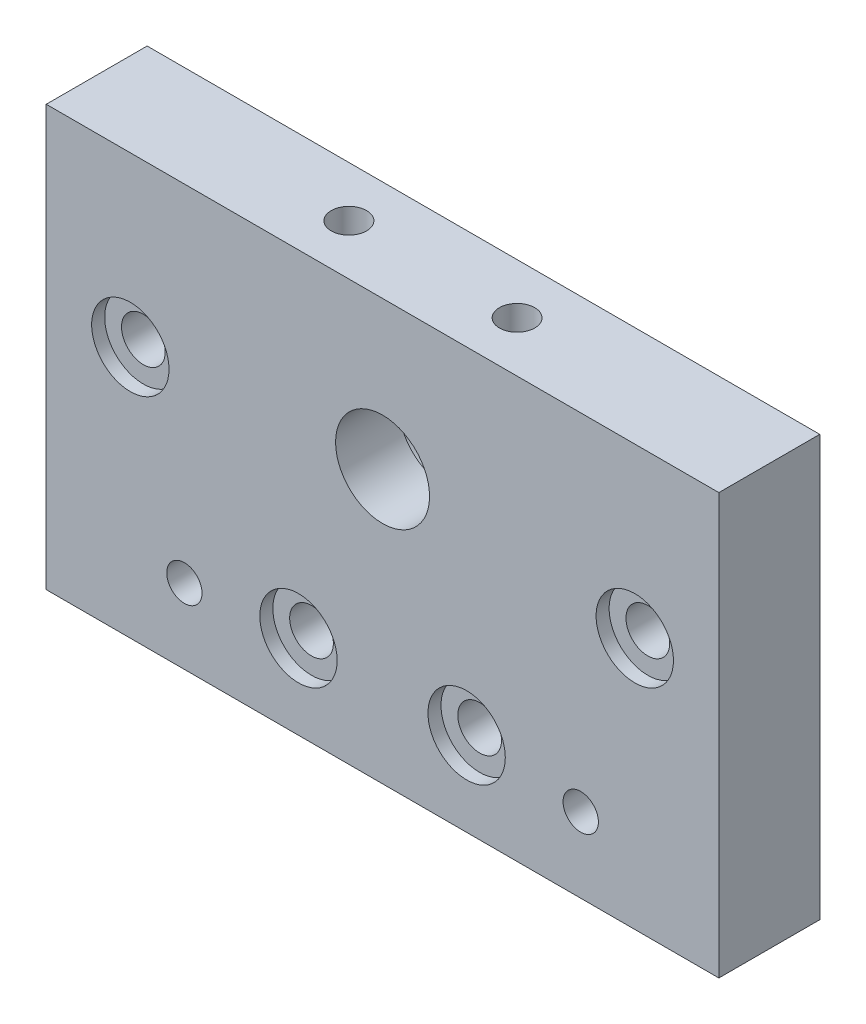
ISO-10303-21;
HEADER;
FILE_DESCRIPTION(('STEP AP214'),'2;1');
FILE_NAME('part.step','',(''),(''),'','','');
FILE_SCHEMA(('AUTOMOTIVE_DESIGN { 1 0 10303 214 1 1 1 1 }'));
ENDSEC;
DATA;
#1=APPLICATION_CONTEXT('core data for automotive mechanical design processes');
#2=APPLICATION_PROTOCOL_DEFINITION('international standard','automotive_design',2000,#1);
#3=PRODUCT_CONTEXT('',#1,'mechanical');
#4=PRODUCT('Part','Part','',(#3));
#5=PRODUCT_RELATED_PRODUCT_CATEGORY('part','',(#4));
#6=PRODUCT_DEFINITION_FORMATION('','',#4);
#7=PRODUCT_DEFINITION_CONTEXT('part definition',#1,'design');
#8=PRODUCT_DEFINITION('design','',#6,#7);
#9=PRODUCT_DEFINITION_SHAPE('','',#8);
#10=(LENGTH_UNIT() NAMED_UNIT(*) SI_UNIT(.MILLI.,.METRE.));
#11=(NAMED_UNIT(*) PLANE_ANGLE_UNIT() SI_UNIT($,.RADIAN.));
#12=(NAMED_UNIT(*) SI_UNIT($,.STERADIAN.) SOLID_ANGLE_UNIT());
#13=UNCERTAINTY_MEASURE_WITH_UNIT(LENGTH_MEASURE(1.E-05),#10,'distance_accuracy_value','');
#14=(GEOMETRIC_REPRESENTATION_CONTEXT(3) GLOBAL_UNCERTAINTY_ASSIGNED_CONTEXT((#13)) GLOBAL_UNIT_ASSIGNED_CONTEXT((#10,
#11,#12)) REPRESENTATION_CONTEXT('',''));
#15=CARTESIAN_POINT('',(0.,0.,0.));
#16=DIRECTION('',(0.,0.,1.));
#17=DIRECTION('',(1.,0.,0.));
#18=AXIS2_PLACEMENT_3D('',#15,#16,#17);
#19=CARTESIAN_POINT('',(40.,32.4,12.));
#20=DIRECTION('',(0.,0.,-1.));
#21=DIRECTION('',(-1.,0.,0.));
#22=AXIS2_PLACEMENT_3D('',#19,#20,#21);
#23=CYLINDRICAL_SURFACE('',#22,5.588);
#24=CARTESIAN_POINT('',(40.,32.4,12.));
#25=DIRECTION('',(0.,0.,1.));
#26=DIRECTION('',(1.,0.,0.));
#27=AXIS2_PLACEMENT_3D('',#24,#25,#26);
#28=CIRCLE('',#27,5.588);
#29=CARTESIAN_POINT('',(45.588,32.4,12.));
#30=VERTEX_POINT('',#29);
#31=EDGE_CURVE('E163',#30,#30,#28,.T.);
#32=ORIENTED_EDGE('',*,*,#31,.T.);
#33=EDGE_LOOP('',(#32));
#34=FACE_BOUND('',#33,.T.);
#35=CARTESIAN_POINT('',(40.,32.4,4.5));
#36=DIRECTION('',(0.,0.,-1.));
#37=DIRECTION('',(-1.,0.,0.));
#38=AXIS2_PLACEMENT_3D('',#35,#36,#37);
#39=CIRCLE('',#38,5.588);
#40=CARTESIAN_POINT('',(34.412,32.4,4.5));
#41=VERTEX_POINT('',#40);
#42=EDGE_CURVE('E36',#41,#41,#39,.T.);
#43=ORIENTED_EDGE('',*,*,#42,.T.);
#44=EDGE_LOOP('',(#43));
#45=FACE_BOUND('',#44,.T.);
#46=ADVANCED_FACE('F32',(#34,#45),#23,.F.);
#47=CARTESIAN_POINT('',(70.,30.,12.));
#48=DIRECTION('',(0.,0.,-1.));
#49=DIRECTION('',(-1.,0.,0.));
#50=AXIS2_PLACEMENT_3D('',#47,#48,#49);
#51=CYLINDRICAL_SURFACE('',#50,2.59999999999999);
#52=CARTESIAN_POINT('',(70.,30.,0.));
#53=DIRECTION('',(0.,0.,1.));
#54=DIRECTION('',(-1.,0.,0.));
#55=AXIS2_PLACEMENT_3D('',#52,#53,#54);
#56=CIRCLE('',#55,2.59999999999999);
#57=CARTESIAN_POINT('',(67.4,30.,0.));
#58=VERTEX_POINT('',#57);
#59=EDGE_CURVE('E151',#58,#58,#56,.T.);
#60=ORIENTED_EDGE('',*,*,#59,.F.);
#61=EDGE_LOOP('',(#60));
#62=FACE_BOUND('',#61,.T.);
#63=CARTESIAN_POINT('',(70.,30.,10.45));
#64=DIRECTION('',(0.,0.,1.));
#65=DIRECTION('',(1.,0.,0.));
#66=AXIS2_PLACEMENT_3D('',#63,#64,#65);
#67=CIRCLE('',#66,2.59999999999999);
#68=CARTESIAN_POINT('',(72.6,30.,10.45));
#69=VERTEX_POINT('',#68);
#70=EDGE_CURVE('E127',#69,#69,#67,.T.);
#71=ORIENTED_EDGE('',*,*,#70,.T.);
#72=EDGE_LOOP('',(#71));
#73=FACE_BOUND('',#72,.T.);
#74=ADVANCED_FACE('F192',(#62,#73),#51,.F.);
#75=CARTESIAN_POINT('',(50.,10.,12.));
#76=DIRECTION('',(0.,0.,-1.));
#77=DIRECTION('',(-1.,0.,0.));
#78=AXIS2_PLACEMENT_3D('',#75,#76,#77);
#79=CYLINDRICAL_SURFACE('',#78,2.59999999999999);
#80=CARTESIAN_POINT('',(50.,10.,0.));
#81=DIRECTION('',(0.,0.,1.));
#82=DIRECTION('',(-1.,0.,0.));
#83=AXIS2_PLACEMENT_3D('',#80,#81,#82);
#84=CIRCLE('',#83,2.59999999999999);
#85=CARTESIAN_POINT('',(47.4,10.,0.));
#86=VERTEX_POINT('',#85);
#87=EDGE_CURVE('E154',#86,#86,#84,.T.);
#88=ORIENTED_EDGE('',*,*,#87,.F.);
#89=EDGE_LOOP('',(#88));
#90=FACE_BOUND('',#89,.T.);
#91=CARTESIAN_POINT('',(50.,10.,10.45));
#92=DIRECTION('',(0.,0.,1.));
#93=DIRECTION('',(1.,0.,0.));
#94=AXIS2_PLACEMENT_3D('',#91,#92,#93);
#95=CIRCLE('',#94,2.59999999999999);
#96=CARTESIAN_POINT('',(52.6,10.,10.45));
#97=VERTEX_POINT('',#96);
#98=EDGE_CURVE('E133',#97,#97,#95,.T.);
#99=ORIENTED_EDGE('',*,*,#98,.T.);
#100=EDGE_LOOP('',(#99));
#101=FACE_BOUND('',#100,.T.);
#102=ADVANCED_FACE('F260',(#90,#101),#79,.F.);
#103=CARTESIAN_POINT('',(30.,10.,12.));
#104=DIRECTION('',(0.,0.,-1.));
#105=DIRECTION('',(-1.,0.,0.));
#106=AXIS2_PLACEMENT_3D('',#103,#104,#105);
#107=CYLINDRICAL_SURFACE('',#106,2.59999999999999);
#108=CARTESIAN_POINT('',(30.,10.,0.));
#109=DIRECTION('',(0.,0.,1.));
#110=DIRECTION('',(1.,0.,0.));
#111=AXIS2_PLACEMENT_3D('',#108,#109,#110);
#112=CIRCLE('',#111,2.59999999999999);
#113=CARTESIAN_POINT('',(32.6,10.,0.));
#114=VERTEX_POINT('',#113);
#115=EDGE_CURVE('E160',#114,#114,#112,.T.);
#116=ORIENTED_EDGE('',*,*,#115,.F.);
#117=EDGE_LOOP('',(#116));
#118=FACE_BOUND('',#117,.T.);
#119=CARTESIAN_POINT('',(30.,10.,10.45));
#120=DIRECTION('',(0.,0.,1.));
#121=DIRECTION('',(1.,0.,0.));
#122=AXIS2_PLACEMENT_3D('',#119,#120,#121);
#123=CIRCLE('',#122,2.59999999999999);
#124=CARTESIAN_POINT('',(32.6,10.,10.45));
#125=VERTEX_POINT('',#124);
#126=EDGE_CURVE('E140',#125,#125,#123,.T.);
#127=ORIENTED_EDGE('',*,*,#126,.T.);
#128=EDGE_LOOP('',(#127));
#129=FACE_BOUND('',#128,.T.);
#130=ADVANCED_FACE('F265',(#118,#129),#107,.F.);
#131=CARTESIAN_POINT('',(9.99999999999999,30.,12.));
#132=DIRECTION('',(0.,0.,-1.));
#133=DIRECTION('',(-1.,0.,0.));
#134=AXIS2_PLACEMENT_3D('',#131,#132,#133);
#135=CYLINDRICAL_SURFACE('',#134,2.6);
#136=CARTESIAN_POINT('',(9.99999999999999,30.,0.));
#137=DIRECTION('',(0.,0.,1.));
#138=DIRECTION('',(1.,0.,0.));
#139=AXIS2_PLACEMENT_3D('',#136,#137,#138);
#140=CIRCLE('',#139,2.6);
#141=CARTESIAN_POINT('',(12.6,30.,0.));
#142=VERTEX_POINT('',#141);
#143=EDGE_CURVE('E157',#142,#142,#140,.T.);
#144=ORIENTED_EDGE('',*,*,#143,.F.);
#145=EDGE_LOOP('',(#144));
#146=FACE_BOUND('',#145,.T.);
#147=CARTESIAN_POINT('',(9.99999999999999,30.,10.45));
#148=DIRECTION('',(0.,0.,1.));
#149=DIRECTION('',(1.,0.,0.));
#150=AXIS2_PLACEMENT_3D('',#147,#148,#149);
#151=CIRCLE('',#150,2.6);
#152=CARTESIAN_POINT('',(12.6,30.,10.45));
#153=VERTEX_POINT('',#152);
#154=EDGE_CURVE('E147',#153,#153,#151,.T.);
#155=ORIENTED_EDGE('',*,*,#154,.T.);
#156=EDGE_LOOP('',(#155));
#157=FACE_BOUND('',#156,.T.);
#158=ADVANCED_FACE('F212',(#146,#157),#135,.F.);
#159=CARTESIAN_POINT('',(0.,0.,12.));
#160=DIRECTION('',(0.,0.,-1.));
#161=DIRECTION('',(-1.,0.,0.));
#162=AXIS2_PLACEMENT_3D('',#159,#160,#161);
#163=PLANE('',#162);
#164=CARTESIAN_POINT('',(16.43,8.9,12.));
#165=DIRECTION('',(0.,0.,1.));
#166=DIRECTION('',(1.,0.,0.));
#167=AXIS2_PLACEMENT_3D('',#164,#165,#166);
#168=CIRCLE('',#167,2.09999999999999);
#169=CARTESIAN_POINT('',(18.53,8.9,12.));
#170=VERTEX_POINT('',#169);
#171=EDGE_CURVE('E111',#170,#170,#168,.T.);
#172=ORIENTED_EDGE('',*,*,#171,.F.);
#173=EDGE_LOOP('',(#172));
#174=FACE_BOUND('',#173,.T.);
#175=CARTESIAN_POINT('',(63.57,8.90000000000001,12.));
#176=DIRECTION('',(0.,0.,1.));
#177=DIRECTION('',(1.,0.,0.));
#178=AXIS2_PLACEMENT_3D('',#175,#176,#177);
#179=CIRCLE('',#178,2.09999999999999);
#180=CARTESIAN_POINT('',(65.67,8.90000000000001,12.));
#181=VERTEX_POINT('',#180);
#182=EDGE_CURVE('E117',#181,#181,#179,.T.);
#183=ORIENTED_EDGE('',*,*,#182,.F.);
#184=EDGE_LOOP('',(#183));
#185=FACE_BOUND('',#184,.T.);
#186=CARTESIAN_POINT('',(70.,30.,12.));
#187=DIRECTION('',(0.,0.,1.));
#188=DIRECTION('',(1.,0.,0.));
#189=AXIS2_PLACEMENT_3D('',#186,#187,#188);
#190=CIRCLE('',#189,4.6);
#191=CARTESIAN_POINT('',(74.6,30.,12.));
#192=VERTEX_POINT('',#191);
#193=EDGE_CURVE('E123',#192,#192,#190,.T.);
#194=ORIENTED_EDGE('',*,*,#193,.F.);
#195=EDGE_LOOP('',(#194));
#196=FACE_BOUND('',#195,.T.);
#197=CARTESIAN_POINT('',(50.,10.,12.));
#198=DIRECTION('',(0.,0.,1.));
#199=DIRECTION('',(1.,0.,0.));
#200=AXIS2_PLACEMENT_3D('',#197,#198,#199);
#201=CIRCLE('',#200,4.6);
#202=CARTESIAN_POINT('',(54.6,10.,12.));
#203=VERTEX_POINT('',#202);
#204=EDGE_CURVE('E134',#203,#203,#201,.T.);
#205=ORIENTED_EDGE('',*,*,#204,.F.);
#206=EDGE_LOOP('',(#205));
#207=FACE_BOUND('',#206,.T.);
#208=CARTESIAN_POINT('',(30.,10.,12.));
#209=DIRECTION('',(0.,0.,1.));
#210=DIRECTION('',(1.,0.,0.));
#211=AXIS2_PLACEMENT_3D('',#208,#209,#210);
#212=CIRCLE('',#211,4.6);
#213=CARTESIAN_POINT('',(34.6,10.,12.));
#214=VERTEX_POINT('',#213);
#215=EDGE_CURVE('E141',#214,#214,#212,.T.);
#216=ORIENTED_EDGE('',*,*,#215,.F.);
#217=EDGE_LOOP('',(#216));
#218=FACE_BOUND('',#217,.T.);
#219=CARTESIAN_POINT('',(9.99999999999999,30.,12.));
#220=DIRECTION('',(0.,0.,1.));
#221=DIRECTION('',(1.,0.,0.));
#222=AXIS2_PLACEMENT_3D('',#219,#220,#221);
#223=CIRCLE('',#222,4.6);
#224=CARTESIAN_POINT('',(14.6,30.,12.));
#225=VERTEX_POINT('',#224);
#226=EDGE_CURVE('E148',#225,#225,#223,.T.);
#227=ORIENTED_EDGE('',*,*,#226,.F.);
#228=EDGE_LOOP('',(#227));
#229=FACE_BOUND('',#228,.T.);
#230=DIRECTION('',(0.,-1.,0.));
#231=VECTOR('',#230,1.);
#232=CARTESIAN_POINT('',(0.,0.,12.));
#233=LINE('',#232,#231);
#234=CARTESIAN_POINT('',(0.,50.,12.));
#235=VERTEX_POINT('',#234);
#236=CARTESIAN_POINT('',(0.,0.,12.));
#237=VERTEX_POINT('',#236);
#238=EDGE_CURVE('E167',#235,#237,#233,.T.);
#239=ORIENTED_EDGE('',*,*,#238,.T.);
#240=DIRECTION('',(1.,0.,0.));
#241=VECTOR('',#240,1.);
#242=CARTESIAN_POINT('',(0.,0.,12.));
#243=LINE('',#242,#241);
#244=CARTESIAN_POINT('',(80.,0.,12.));
#245=VERTEX_POINT('',#244);
#246=EDGE_CURVE('E82',#237,#245,#243,.T.);
#247=ORIENTED_EDGE('',*,*,#246,.T.);
#248=DIRECTION('',(0.,1.,0.));
#249=VECTOR('',#248,1.);
#250=CARTESIAN_POINT('',(80.,0.,12.));
#251=LINE('',#250,#249);
#252=CARTESIAN_POINT('',(80.,50.,12.));
#253=VERTEX_POINT('',#252);
#254=EDGE_CURVE('E170',#245,#253,#251,.T.);
#255=ORIENTED_EDGE('',*,*,#254,.T.);
#256=DIRECTION('',(-1.,0.,0.));
#257=VECTOR('',#256,1.);
#258=CARTESIAN_POINT('',(0.,50.,12.));
#259=LINE('',#258,#257);
#260=EDGE_CURVE('E51',#253,#235,#259,.T.);
#261=ORIENTED_EDGE('',*,*,#260,.T.);
#262=EDGE_LOOP('',(#239,#247,#255,#261));
#263=FACE_BOUND('',#262,.T.);
#264=ORIENTED_EDGE('',*,*,#31,.F.);
#265=EDGE_LOOP('',(#264));
#266=FACE_BOUND('',#265,.T.);
#267=ADVANCED_FACE('F208',(#174,#185,#196,#207,#218,#229,#263,#266),#163,.F.);
#268=CARTESIAN_POINT('',(0.,0.,0.));
#269=DIRECTION('',(0.,0.,-1.));
#270=DIRECTION('',(-1.,0.,0.));
#271=AXIS2_PLACEMENT_3D('',#268,#269,#270);
#272=PLANE('',#271);
#273=CARTESIAN_POINT('',(40.,32.4,0.));
#274=DIRECTION('',(0.,0.,-1.));
#275=DIRECTION('',(-1.,0.,0.));
#276=AXIS2_PLACEMENT_3D('',#273,#274,#275);
#277=CIRCLE('',#276,8.05);
#278=CARTESIAN_POINT('',(31.95,32.4,0.));
#279=VERTEX_POINT('',#278);
#280=EDGE_CURVE('E233',#279,#279,#277,.T.);
#281=ORIENTED_EDGE('',*,*,#280,.F.);
#282=EDGE_LOOP('',(#281));
#283=FACE_BOUND('',#282,.T.);
#284=CARTESIAN_POINT('',(16.43,8.9,0.));
#285=DIRECTION('',(0.,0.,1.));
#286=DIRECTION('',(1.,0.,0.));
#287=AXIS2_PLACEMENT_3D('',#284,#285,#286);
#288=CIRCLE('',#287,2.1);
#289=CARTESIAN_POINT('',(18.53,8.9,0.));
#290=VERTEX_POINT('',#289);
#291=EDGE_CURVE('E114',#290,#290,#288,.T.);
#292=ORIENTED_EDGE('',*,*,#291,.T.);
#293=EDGE_LOOP('',(#292));
#294=FACE_BOUND('',#293,.T.);
#295=CARTESIAN_POINT('',(63.57,8.90000000000001,0.));
#296=DIRECTION('',(0.,0.,1.));
#297=DIRECTION('',(1.,0.,0.));
#298=AXIS2_PLACEMENT_3D('',#295,#296,#297);
#299=CIRCLE('',#298,2.1);
#300=CARTESIAN_POINT('',(65.67,8.90000000000001,0.));
#301=VERTEX_POINT('',#300);
#302=EDGE_CURVE('E120',#301,#301,#299,.T.);
#303=ORIENTED_EDGE('',*,*,#302,.T.);
#304=EDGE_LOOP('',(#303));
#305=FACE_BOUND('',#304,.T.);
#306=ORIENTED_EDGE('',*,*,#87,.T.);
#307=EDGE_LOOP('',(#306));
#308=FACE_BOUND('',#307,.T.);
#309=ORIENTED_EDGE('',*,*,#115,.T.);
#310=EDGE_LOOP('',(#309));
#311=FACE_BOUND('',#310,.T.);
#312=DIRECTION('',(0.,-1.,0.));
#313=VECTOR('',#312,1.);
#314=CARTESIAN_POINT('',(0.,0.,0.));
#315=LINE('',#314,#313);
#316=CARTESIAN_POINT('',(0.,50.,0.));
#317=VERTEX_POINT('',#316);
#318=CARTESIAN_POINT('',(0.,0.,0.));
#319=VERTEX_POINT('',#318);
#320=EDGE_CURVE('E166',#317,#319,#315,.T.);
#321=ORIENTED_EDGE('',*,*,#320,.F.);
#322=DIRECTION('',(-1.,0.,0.));
#323=VECTOR('',#322,1.);
#324=CARTESIAN_POINT('',(0.,50.,0.));
#325=LINE('',#324,#323);
#326=CARTESIAN_POINT('',(80.,50.,0.));
#327=VERTEX_POINT('',#326);
#328=EDGE_CURVE('E75',#327,#317,#325,.T.);
#329=ORIENTED_EDGE('',*,*,#328,.F.);
#330=DIRECTION('',(0.,1.,0.));
#331=VECTOR('',#330,1.);
#332=CARTESIAN_POINT('',(80.,0.,0.));
#333=LINE('',#332,#331);
#334=CARTESIAN_POINT('',(80.,0.,0.));
#335=VERTEX_POINT('',#334);
#336=EDGE_CURVE('E69',#335,#327,#333,.T.);
#337=ORIENTED_EDGE('',*,*,#336,.F.);
#338=DIRECTION('',(1.,0.,0.));
#339=VECTOR('',#338,1.);
#340=CARTESIAN_POINT('',(0.,0.,0.));
#341=LINE('',#340,#339);
#342=EDGE_CURVE('E176',#319,#335,#341,.T.);
#343=ORIENTED_EDGE('',*,*,#342,.F.);
#344=EDGE_LOOP('',(#321,#329,#337,#343));
#345=FACE_BOUND('',#344,.T.);
#346=ORIENTED_EDGE('',*,*,#143,.T.);
#347=EDGE_LOOP('',(#346));
#348=FACE_BOUND('',#347,.T.);
#349=ORIENTED_EDGE('',*,*,#59,.T.);
#350=EDGE_LOOP('',(#349));
#351=FACE_BOUND('',#350,.T.);
#352=ADVANCED_FACE('F211',(#283,#294,#305,#308,#311,#345,#348,#351),#272,.T.);
#353=CARTESIAN_POINT('',(0.,0.,12.));
#354=DIRECTION('',(1.,0.,0.));
#355=DIRECTION('',(0.,0.,-1.));
#356=AXIS2_PLACEMENT_3D('',#353,#354,#355);
#357=PLANE('',#356);
#358=ORIENTED_EDGE('',*,*,#320,.T.);
#359=DIRECTION('',(0.,0.,-1.));
#360=VECTOR('',#359,1.);
#361=CARTESIAN_POINT('',(0.,0.,12.));
#362=LINE('',#361,#360);
#363=EDGE_CURVE('E11',#237,#319,#362,.T.);
#364=ORIENTED_EDGE('',*,*,#363,.F.);
#365=ORIENTED_EDGE('',*,*,#238,.F.);
#366=DIRECTION('',(0.,0.,-1.));
#367=VECTOR('',#366,1.);
#368=CARTESIAN_POINT('',(0.,50.,12.));
#369=LINE('',#368,#367);
#370=EDGE_CURVE('E173',#235,#317,#369,.T.);
#371=ORIENTED_EDGE('',*,*,#370,.T.);
#372=EDGE_LOOP('',(#358,#364,#365,#371));
#373=FACE_BOUND('',#372,.T.);
#374=ADVANCED_FACE('F34',(#373),#357,.F.);
#375=CARTESIAN_POINT('',(0.,0.,12.));
#376=DIRECTION('',(0.,1.,0.));
#377=DIRECTION('',(0.,0.,1.));
#378=AXIS2_PLACEMENT_3D('',#375,#376,#377);
#379=PLANE('',#378);
#380=ORIENTED_EDGE('',*,*,#342,.T.);
#381=DIRECTION('',(0.,0.,-1.));
#382=VECTOR('',#381,1.);
#383=CARTESIAN_POINT('',(80.,0.,12.));
#384=LINE('',#383,#382);
#385=EDGE_CURVE('E42',#245,#335,#384,.T.);
#386=ORIENTED_EDGE('',*,*,#385,.F.);
#387=ORIENTED_EDGE('',*,*,#246,.F.);
#388=ORIENTED_EDGE('',*,*,#363,.T.);
#389=EDGE_LOOP('',(#380,#386,#387,#388));
#390=FACE_BOUND('',#389,.T.);
#391=ADVANCED_FACE('F284',(#390),#379,.F.);
#392=CARTESIAN_POINT('',(80.,0.,12.));
#393=DIRECTION('',(-1.,0.,0.));
#394=DIRECTION('',(0.,0.,1.));
#395=AXIS2_PLACEMENT_3D('',#392,#393,#394);
#396=PLANE('',#395);
#397=ORIENTED_EDGE('',*,*,#336,.T.);
#398=DIRECTION('',(0.,0.,-1.));
#399=VECTOR('',#398,1.);
#400=CARTESIAN_POINT('',(80.,50.,12.));
#401=LINE('',#400,#399);
#402=EDGE_CURVE('E181',#253,#327,#401,.T.);
#403=ORIENTED_EDGE('',*,*,#402,.F.);
#404=ORIENTED_EDGE('',*,*,#254,.F.);
#405=ORIENTED_EDGE('',*,*,#385,.T.);
#406=EDGE_LOOP('',(#397,#403,#404,#405));
#407=FACE_BOUND('',#406,.T.);
#408=ADVANCED_FACE('F281',(#407),#396,.F.);
#409=CARTESIAN_POINT('',(0.,50.,12.));
#410=DIRECTION('',(0.,-1.,0.));
#411=DIRECTION('',(0.,0.,-1.));
#412=AXIS2_PLACEMENT_3D('',#409,#410,#411);
#413=PLANE('',#412);
#414=CARTESIAN_POINT('',(30.,50.,6.));
#415=DIRECTION('',(0.,1.,0.));
#416=DIRECTION('',(0.,0.,1.));
#417=AXIS2_PLACEMENT_3D('',#414,#415,#416);
#418=CIRCLE('',#417,2.09999999999999);
#419=CARTESIAN_POINT('',(30.,50.,8.09999999999999));
#420=VERTEX_POINT('',#419);
#421=EDGE_CURVE('E100',#420,#420,#418,.T.);
#422=ORIENTED_EDGE('',*,*,#421,.F.);
#423=EDGE_LOOP('',(#422));
#424=FACE_BOUND('',#423,.T.);
#425=CARTESIAN_POINT('',(50.,50.,6.));
#426=DIRECTION('',(0.,1.,0.));
#427=DIRECTION('',(0.,0.,1.));
#428=AXIS2_PLACEMENT_3D('',#425,#426,#427);
#429=CIRCLE('',#428,2.09999999999999);
#430=CARTESIAN_POINT('',(50.,50.,8.09999999999999));
#431=VERTEX_POINT('',#430);
#432=EDGE_CURVE('E99',#431,#431,#429,.T.);
#433=ORIENTED_EDGE('',*,*,#432,.F.);
#434=EDGE_LOOP('',(#433));
#435=FACE_BOUND('',#434,.T.);
#436=ORIENTED_EDGE('',*,*,#328,.T.);
#437=ORIENTED_EDGE('',*,*,#370,.F.);
#438=ORIENTED_EDGE('',*,*,#260,.F.);
#439=ORIENTED_EDGE('',*,*,#402,.T.);
#440=EDGE_LOOP('',(#436,#437,#438,#439));
#441=FACE_BOUND('',#440,.T.);
#442=ADVANCED_FACE('F278',(#424,#435,#441),#413,.F.);
#443=CARTESIAN_POINT('',(9.99999999999999,30.,10.45));
#444=DIRECTION('',(0.,0.,1.));
#445=DIRECTION('',(1.,0.,0.));
#446=AXIS2_PLACEMENT_3D('',#443,#444,#445);
#447=CYLINDRICAL_SURFACE('',#446,4.6);
#448=CARTESIAN_POINT('',(9.99999999999999,30.,10.45));
#449=DIRECTION('',(0.,0.,1.));
#450=DIRECTION('',(1.,0.,0.));
#451=AXIS2_PLACEMENT_3D('',#448,#449,#450);
#452=CIRCLE('',#451,4.6);
#453=CARTESIAN_POINT('',(14.6,30.,10.45));
#454=VERTEX_POINT('',#453);
#455=EDGE_CURVE('E144',#454,#454,#452,.T.);
#456=ORIENTED_EDGE('',*,*,#455,.F.);
#457=EDGE_LOOP('',(#456));
#458=FACE_BOUND('',#457,.T.);
#459=ORIENTED_EDGE('',*,*,#226,.T.);
#460=EDGE_LOOP('',(#459));
#461=FACE_BOUND('',#460,.T.);
#462=ADVANCED_FACE('F269',(#458,#461),#447,.F.);
#463=CARTESIAN_POINT('',(9.99999999999999,30.,10.45));
#464=DIRECTION('',(0.,0.,1.));
#465=DIRECTION('',(1.,0.,0.));
#466=AXIS2_PLACEMENT_3D('',#463,#464,#465);
#467=PLANE('',#466);
#468=ORIENTED_EDGE('',*,*,#154,.F.);
#469=EDGE_LOOP('',(#468));
#470=FACE_BOUND('',#469,.T.);
#471=ORIENTED_EDGE('',*,*,#455,.T.);
#472=EDGE_LOOP('',(#471));
#473=FACE_BOUND('',#472,.T.);
#474=ADVANCED_FACE('F352',(#470,#473),#467,.T.);
#475=CARTESIAN_POINT('',(30.,10.,10.45));
#476=DIRECTION('',(0.,0.,1.));
#477=DIRECTION('',(1.,0.,0.));
#478=AXIS2_PLACEMENT_3D('',#475,#476,#477);
#479=CYLINDRICAL_SURFACE('',#478,4.6);
#480=CARTESIAN_POINT('',(30.,10.,10.45));
#481=DIRECTION('',(0.,0.,1.));
#482=DIRECTION('',(1.,0.,0.));
#483=AXIS2_PLACEMENT_3D('',#480,#481,#482);
#484=CIRCLE('',#483,4.6);
#485=CARTESIAN_POINT('',(34.6,10.,10.45));
#486=VERTEX_POINT('',#485);
#487=EDGE_CURVE('E137',#486,#486,#484,.T.);
#488=ORIENTED_EDGE('',*,*,#487,.F.);
#489=EDGE_LOOP('',(#488));
#490=FACE_BOUND('',#489,.T.);
#491=ORIENTED_EDGE('',*,*,#215,.T.);
#492=EDGE_LOOP('',(#491));
#493=FACE_BOUND('',#492,.T.);
#494=ADVANCED_FACE('F358',(#490,#493),#479,.F.);
#495=CARTESIAN_POINT('',(30.,10.,10.45));
#496=DIRECTION('',(0.,0.,1.));
#497=DIRECTION('',(1.,0.,0.));
#498=AXIS2_PLACEMENT_3D('',#495,#496,#497);
#499=PLANE('',#498);
#500=ORIENTED_EDGE('',*,*,#126,.F.);
#501=EDGE_LOOP('',(#500));
#502=FACE_BOUND('',#501,.T.);
#503=ORIENTED_EDGE('',*,*,#487,.T.);
#504=EDGE_LOOP('',(#503));
#505=FACE_BOUND('',#504,.T.);
#506=ADVANCED_FACE('F365',(#502,#505),#499,.T.);
#507=CARTESIAN_POINT('',(50.,10.,10.45));
#508=DIRECTION('',(0.,0.,1.));
#509=DIRECTION('',(1.,0.,0.));
#510=AXIS2_PLACEMENT_3D('',#507,#508,#509);
#511=CYLINDRICAL_SURFACE('',#510,4.6);
#512=CARTESIAN_POINT('',(50.,10.,10.45));
#513=DIRECTION('',(0.,0.,1.));
#514=DIRECTION('',(1.,0.,0.));
#515=AXIS2_PLACEMENT_3D('',#512,#513,#514);
#516=CIRCLE('',#515,4.6);
#517=CARTESIAN_POINT('',(54.6,10.,10.45));
#518=VERTEX_POINT('',#517);
#519=EDGE_CURVE('E130',#518,#518,#516,.T.);
#520=ORIENTED_EDGE('',*,*,#519,.F.);
#521=EDGE_LOOP('',(#520));
#522=FACE_BOUND('',#521,.T.);
#523=ORIENTED_EDGE('',*,*,#204,.T.);
#524=EDGE_LOOP('',(#523));
#525=FACE_BOUND('',#524,.T.);
#526=ADVANCED_FACE('F373',(#522,#525),#511,.F.);
#527=CARTESIAN_POINT('',(50.,10.,10.45));
#528=DIRECTION('',(0.,0.,1.));
#529=DIRECTION('',(1.,0.,0.));
#530=AXIS2_PLACEMENT_3D('',#527,#528,#529);
#531=PLANE('',#530);
#532=ORIENTED_EDGE('',*,*,#98,.F.);
#533=EDGE_LOOP('',(#532));
#534=FACE_BOUND('',#533,.T.);
#535=ORIENTED_EDGE('',*,*,#519,.T.);
#536=EDGE_LOOP('',(#535));
#537=FACE_BOUND('',#536,.T.);
#538=ADVANCED_FACE('F204',(#534,#537),#531,.T.);
#539=CARTESIAN_POINT('',(70.,30.,10.45));
#540=DIRECTION('',(0.,0.,1.));
#541=DIRECTION('',(1.,0.,0.));
#542=AXIS2_PLACEMENT_3D('',#539,#540,#541);
#543=CYLINDRICAL_SURFACE('',#542,4.6);
#544=CARTESIAN_POINT('',(70.,30.,10.45));
#545=DIRECTION('',(0.,0.,1.));
#546=DIRECTION('',(1.,0.,0.));
#547=AXIS2_PLACEMENT_3D('',#544,#545,#546);
#548=CIRCLE('',#547,4.6);
#549=CARTESIAN_POINT('',(74.6,30.,10.45));
#550=VERTEX_POINT('',#549);
#551=EDGE_CURVE('E124',#550,#550,#548,.T.);
#552=ORIENTED_EDGE('',*,*,#551,.F.);
#553=EDGE_LOOP('',(#552));
#554=FACE_BOUND('',#553,.T.);
#555=ORIENTED_EDGE('',*,*,#193,.T.);
#556=EDGE_LOOP('',(#555));
#557=FACE_BOUND('',#556,.T.);
#558=ADVANCED_FACE('F198',(#554,#557),#543,.F.);
#559=CARTESIAN_POINT('',(70.,30.,10.45));
#560=DIRECTION('',(0.,0.,1.));
#561=DIRECTION('',(1.,0.,0.));
#562=AXIS2_PLACEMENT_3D('',#559,#560,#561);
#563=PLANE('',#562);
#564=ORIENTED_EDGE('',*,*,#70,.F.);
#565=EDGE_LOOP('',(#564));
#566=FACE_BOUND('',#565,.T.);
#567=ORIENTED_EDGE('',*,*,#551,.T.);
#568=EDGE_LOOP('',(#567));
#569=FACE_BOUND('',#568,.T.);
#570=ADVANCED_FACE('F194',(#566,#569),#563,.T.);
#571=CARTESIAN_POINT('',(63.57,8.90000000000001,12.));
#572=DIRECTION('',(0.,0.,1.));
#573=DIRECTION('',(1.,0.,0.));
#574=AXIS2_PLACEMENT_3D('',#571,#572,#573);
#575=CYLINDRICAL_SURFACE('',#574,2.1);
#576=ORIENTED_EDGE('',*,*,#302,.F.);
#577=EDGE_LOOP('',(#576));
#578=FACE_BOUND('',#577,.T.);
#579=ORIENTED_EDGE('',*,*,#182,.T.);
#580=EDGE_LOOP('',(#579));
#581=FACE_BOUND('',#580,.T.);
#582=ADVANCED_FACE('F197',(#578,#581),#575,.F.);
#583=CARTESIAN_POINT('',(16.43,8.9,12.));
#584=DIRECTION('',(0.,0.,1.));
#585=DIRECTION('',(1.,0.,0.));
#586=AXIS2_PLACEMENT_3D('',#583,#584,#585);
#587=CYLINDRICAL_SURFACE('',#586,2.09999999999999);
#588=ORIENTED_EDGE('',*,*,#291,.F.);
#589=EDGE_LOOP('',(#588));
#590=FACE_BOUND('',#589,.T.);
#591=ORIENTED_EDGE('',*,*,#171,.T.);
#592=EDGE_LOOP('',(#591));
#593=FACE_BOUND('',#592,.T.);
#594=ADVANCED_FACE('F401',(#590,#593),#587,.F.);
#595=CARTESIAN_POINT('',(50.,36.,6.));
#596=DIRECTION('',(0.,1.,0.));
#597=DIRECTION('',(0.,0.,1.));
#598=AXIS2_PLACEMENT_3D('',#595,#596,#597);
#599=CONICAL_SURFACE('',#598,2.09999999999998,1.02974425867665);
#600=CARTESIAN_POINT('',(50.,34.7381927000421,6.));
#601=VERTEX_POINT('',#600);
#602=VERTEX_LOOP('',#601);
#603=FACE_BOUND('',#602,.T.);
#604=CARTESIAN_POINT('',(50.,36.,6.));
#605=DIRECTION('',(0.,1.,0.));
#606=DIRECTION('',(0.,0.,1.));
#607=AXIS2_PLACEMENT_3D('',#604,#605,#606);
#608=CIRCLE('',#607,2.09999999999998);
#609=CARTESIAN_POINT('',(50.,36.,8.09999999999998));
#610=VERTEX_POINT('',#609);
#611=EDGE_CURVE('E103',#610,#610,#608,.T.);
#612=ORIENTED_EDGE('',*,*,#611,.T.);
#613=EDGE_LOOP('',(#612));
#614=FACE_BOUND('',#613,.T.);
#615=ADVANCED_FACE('F408',(#603,#614),#599,.F.);
#616=CARTESIAN_POINT('',(50.,50.,6.));
#617=DIRECTION('',(0.,1.,0.));
#618=DIRECTION('',(0.,0.,1.));
#619=AXIS2_PLACEMENT_3D('',#616,#617,#618);
#620=CYLINDRICAL_SURFACE('',#619,2.09999999999999);
#621=ORIENTED_EDGE('',*,*,#611,.F.);
#622=EDGE_LOOP('',(#621));
#623=FACE_BOUND('',#622,.T.);
#624=ORIENTED_EDGE('',*,*,#432,.T.);
#625=EDGE_LOOP('',(#624));
#626=FACE_BOUND('',#625,.T.);
#627=ADVANCED_FACE('F93',(#623,#626),#620,.F.);
#628=CARTESIAN_POINT('',(30.,36.,6.));
#629=DIRECTION('',(0.,1.,0.));
#630=DIRECTION('',(0.,0.,1.));
#631=AXIS2_PLACEMENT_3D('',#628,#629,#630);
#632=CONICAL_SURFACE('',#631,2.09999999999998,1.02974425867665);
#633=CARTESIAN_POINT('',(30.,34.7381927000421,6.));
#634=VERTEX_POINT('',#633);
#635=VERTEX_LOOP('',#634);
#636=FACE_BOUND('',#635,.T.);
#637=CARTESIAN_POINT('',(30.,36.,6.));
#638=DIRECTION('',(0.,1.,0.));
#639=DIRECTION('',(0.,0.,1.));
#640=AXIS2_PLACEMENT_3D('',#637,#638,#639);
#641=CIRCLE('',#640,2.09999999999998);
#642=CARTESIAN_POINT('',(30.,36.,8.09999999999998));
#643=VERTEX_POINT('',#642);
#644=EDGE_CURVE('E97',#643,#643,#641,.T.);
#645=ORIENTED_EDGE('',*,*,#644,.T.);
#646=EDGE_LOOP('',(#645));
#647=FACE_BOUND('',#646,.T.);
#648=ADVANCED_FACE('F89',(#636,#647),#632,.F.);
#649=CARTESIAN_POINT('',(30.,50.,6.));
#650=DIRECTION('',(0.,1.,0.));
#651=DIRECTION('',(0.,0.,1.));
#652=AXIS2_PLACEMENT_3D('',#649,#650,#651);
#653=CYLINDRICAL_SURFACE('',#652,2.09999999999999);
#654=ORIENTED_EDGE('',*,*,#644,.F.);
#655=EDGE_LOOP('',(#654));
#656=FACE_BOUND('',#655,.T.);
#657=ORIENTED_EDGE('',*,*,#421,.T.);
#658=EDGE_LOOP('',(#657));
#659=FACE_BOUND('',#658,.T.);
#660=ADVANCED_FACE('F92',(#656,#659),#653,.F.);
#661=CARTESIAN_POINT('',(40.,32.4,4.5));
#662=DIRECTION('',(0.,0.,-1.));
#663=DIRECTION('',(-1.,0.,0.));
#664=AXIS2_PLACEMENT_3D('',#661,#662,#663);
#665=CYLINDRICAL_SURFACE('',#664,8.05);
#666=CARTESIAN_POINT('',(40.,32.4,4.5));
#667=DIRECTION('',(0.,0.,-1.));
#668=DIRECTION('',(-1.,0.,0.));
#669=AXIS2_PLACEMENT_3D('',#666,#667,#668);
#670=CIRCLE('',#669,8.05);
#671=CARTESIAN_POINT('',(31.95,32.4,4.5));
#672=VERTEX_POINT('',#671);
#673=EDGE_CURVE('E231',#672,#672,#670,.T.);
#674=ORIENTED_EDGE('',*,*,#673,.F.);
#675=EDGE_LOOP('',(#674));
#676=FACE_BOUND('',#675,.T.);
#677=ORIENTED_EDGE('',*,*,#280,.T.);
#678=EDGE_LOOP('',(#677));
#679=FACE_BOUND('',#678,.T.);
#680=ADVANCED_FACE('F240',(#676,#679),#665,.F.);
#681=CARTESIAN_POINT('',(40.,32.4,4.5));
#682=DIRECTION('',(0.,0.,-1.));
#683=DIRECTION('',(-1.,0.,0.));
#684=AXIS2_PLACEMENT_3D('',#681,#682,#683);
#685=PLANE('',#684);
#686=ORIENTED_EDGE('',*,*,#42,.F.);
#687=EDGE_LOOP('',(#686));
#688=FACE_BOUND('',#687,.T.);
#689=ORIENTED_EDGE('',*,*,#673,.T.);
#690=EDGE_LOOP('',(#689));
#691=FACE_BOUND('',#690,.T.);
#692=ADVANCED_FACE('F438',(#688,#691),#685,.T.);
#693=CLOSED_SHELL('',(#46,#74,#102,#130,#158,#267,#352,#374,#391,#408,#442,#462,#474,#494,#506,
#526,#538,#558,#570,#582,#594,#615,#627,#648,#660,#680,#692));
#694=MANIFOLD_SOLID_BREP('B2',#693);
#695=ADVANCED_BREP_SHAPE_REPRESENTATION('',(#18,#694),#14);
#696=SHAPE_DEFINITION_REPRESENTATION(#9,#695);
ENDSEC;
END-ISO-10303-21;
